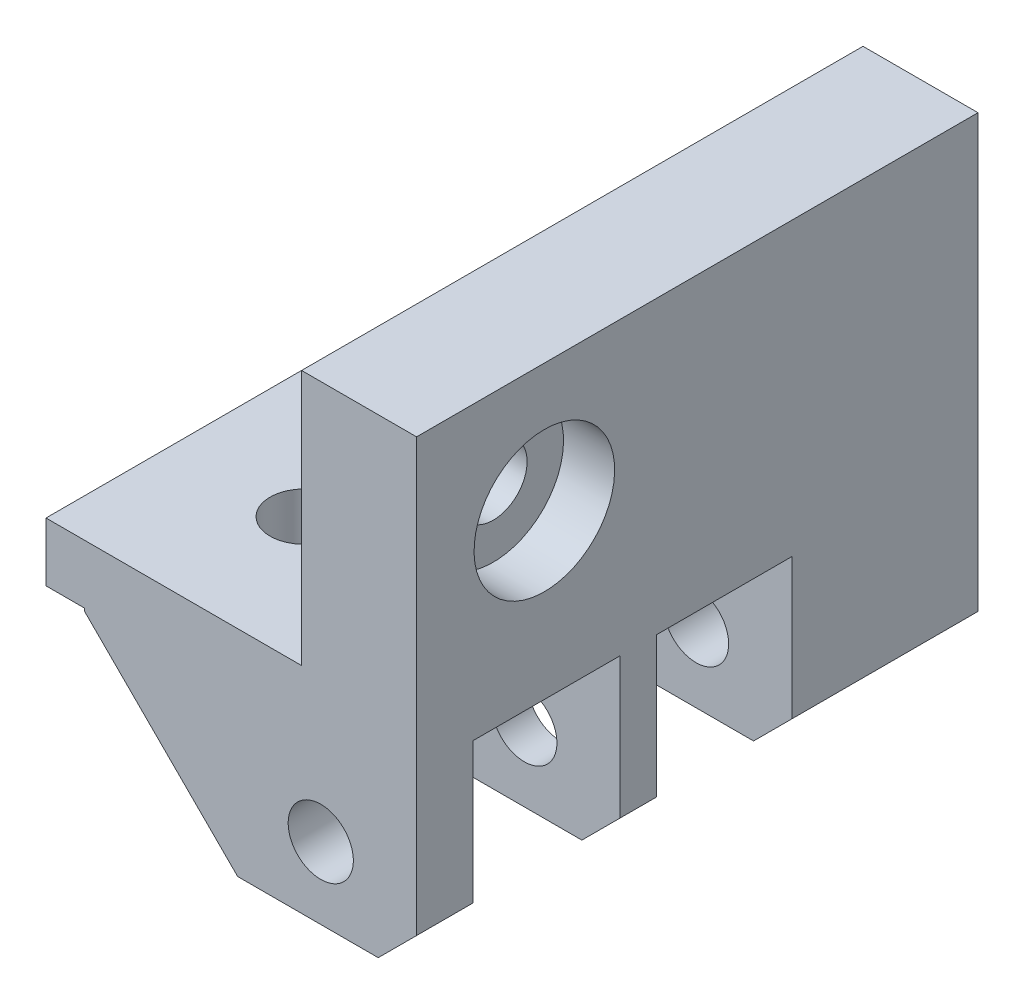
ISO-10303-21;
HEADER;
FILE_DESCRIPTION(('STEP AP214'),'2;1');
FILE_NAME('part.step','',(''),(''),'','','');
FILE_SCHEMA(('AUTOMOTIVE_DESIGN { 1 0 10303 214 1 1 1 1 }'));
ENDSEC;
DATA;
#1=APPLICATION_CONTEXT('core data for automotive mechanical design processes');
#2=APPLICATION_PROTOCOL_DEFINITION('international standard','automotive_design',2000,#1);
#3=PRODUCT_CONTEXT('',#1,'mechanical');
#4=PRODUCT('Part','Part','',(#3));
#5=PRODUCT_RELATED_PRODUCT_CATEGORY('part','',(#4));
#6=PRODUCT_DEFINITION_FORMATION('','',#4);
#7=PRODUCT_DEFINITION_CONTEXT('part definition',#1,'design');
#8=PRODUCT_DEFINITION('design','',#6,#7);
#9=PRODUCT_DEFINITION_SHAPE('','',#8);
#10=(LENGTH_UNIT() NAMED_UNIT(*) SI_UNIT(.MILLI.,.METRE.));
#11=(NAMED_UNIT(*) PLANE_ANGLE_UNIT() SI_UNIT($,.RADIAN.));
#12=(NAMED_UNIT(*) SI_UNIT($,.STERADIAN.) SOLID_ANGLE_UNIT());
#13=UNCERTAINTY_MEASURE_WITH_UNIT(LENGTH_MEASURE(1.E-05),#10,'distance_accuracy_value','');
#14=(GEOMETRIC_REPRESENTATION_CONTEXT(3) GLOBAL_UNCERTAINTY_ASSIGNED_CONTEXT((#13)) GLOBAL_UNIT_ASSIGNED_CONTEXT((#10,
#11,#12)) REPRESENTATION_CONTEXT('',''));
#15=CARTESIAN_POINT('',(0.,0.,0.));
#16=DIRECTION('',(0.,0.,1.));
#17=DIRECTION('',(1.,0.,0.));
#18=AXIS2_PLACEMENT_3D('',#15,#16,#17);
#19=CARTESIAN_POINT('',(-160.,155.,-31.565105608093));
#20=DIRECTION('',(0.,0.,-1.));
#21=DIRECTION('',(0.,-1.,0.));
#22=AXIS2_PLACEMENT_3D('',#19,#20,#21);
#23=PLANE('',#22);
#24=CARTESIAN_POINT('',(-158.500000052155,143.805749978039,-31.565105608093));
#25=DIRECTION('',(0.,0.,1.));
#26=DIRECTION('',(1.,0.,0.));
#27=AXIS2_PLACEMENT_3D('',#24,#25,#26);
#28=CIRCLE('',#27,2.55);
#29=CARTESIAN_POINT('',(-161.050000052155,143.805749978039,-31.565105608093));
#30=VERTEX_POINT('',#29);
#31=EDGE_CURVE('E521',#30,#30,#28,.T.);
#32=ORIENTED_EDGE('',*,*,#31,.F.);
#33=EDGE_LOOP('',(#32));
#34=FACE_BOUND('',#33,.T.);
#35=DIRECTION('',(-1.,0.,0.));
#36=VECTOR('',#35,1.);
#37=CARTESIAN_POINT('',(-160.,150.4,-31.565105608093));
#38=LINE('',#37,#36);
#39=CARTESIAN_POINT('',(-177.000002294779,150.4,-31.565105608093));
#40=VERTEX_POINT('',#39);
#41=CARTESIAN_POINT('',(-180.,150.4,-31.565105608093));
#42=VERTEX_POINT('',#41);
#43=EDGE_CURVE('E421',#40,#42,#38,.T.);
#44=ORIENTED_EDGE('',*,*,#43,.F.);
#45=DIRECTION('',(0.,1.,0.));
#46=VECTOR('',#45,1.);
#47=CARTESIAN_POINT('',(-177.000002294779,152.6,-31.565105608093));
#48=LINE('',#47,#46);
#49=CARTESIAN_POINT('',(-177.000002294779,150.2,-31.565105608093));
#50=VERTEX_POINT('',#49);
#51=EDGE_CURVE('E445',#50,#40,#48,.T.);
#52=ORIENTED_EDGE('',*,*,#51,.F.);
#53=DIRECTION('',(0.707106781186548,-0.707106781186547,0.));
#54=VECTOR('',#53,1.);
#55=CARTESIAN_POINT('',(-170.950001721084,144.149999426305,-31.565105608093));
#56=LINE('',#55,#54);
#57=CARTESIAN_POINT('',(-165.000002294779,138.2,-31.565105608093));
#58=VERTEX_POINT('',#57);
#59=EDGE_CURVE('E466',#50,#58,#56,.T.);
#60=ORIENTED_EDGE('',*,*,#59,.T.);
#61=DIRECTION('',(-1.,0.,0.));
#62=VECTOR('',#61,1.);
#63=CARTESIAN_POINT('',(-164.000002294779,138.2,-31.565105608093));
#64=LINE('',#63,#62);
#65=CARTESIAN_POINT('',(-154.,138.2,-31.565105608093));
#66=VERTEX_POINT('',#65);
#67=EDGE_CURVE('E26',#66,#58,#64,.T.);
#68=ORIENTED_EDGE('',*,*,#67,.F.);
#69=DIRECTION('',(0.707106781186545,0.70710678118655,0.));
#70=VECTOR('',#69,1.);
#71=CARTESIAN_POINT('',(-150.55,141.65,-31.565105608093));
#72=LINE('',#71,#70);
#73=CARTESIAN_POINT('',(-151.,141.2,-31.565105608093));
#74=VERTEX_POINT('',#73);
#75=EDGE_CURVE('E457',#66,#74,#72,.T.);
#76=ORIENTED_EDGE('',*,*,#75,.T.);
#77=DIRECTION('',(0.,1.,0.));
#78=VECTOR('',#77,1.);
#79=CARTESIAN_POINT('',(-151.,175.,-31.565105608093));
#80=LINE('',#79,#78);
#81=CARTESIAN_POINT('',(-151.,175.,-31.565105608093));
#82=VERTEX_POINT('',#81);
#83=EDGE_CURVE('E586',#74,#82,#80,.T.);
#84=ORIENTED_EDGE('',*,*,#83,.T.);
#85=DIRECTION('',(1.,0.,0.));
#86=VECTOR('',#85,1.);
#87=CARTESIAN_POINT('',(-160.,175.,-31.565105608093));
#88=LINE('',#87,#86);
#89=CARTESIAN_POINT('',(-160.,175.,-31.565105608093));
#90=VERTEX_POINT('',#89);
#91=EDGE_CURVE('E507',#90,#82,#88,.T.);
#92=ORIENTED_EDGE('',*,*,#91,.F.);
#93=DIRECTION('',(0.,-1.,0.));
#94=VECTOR('',#93,1.);
#95=CARTESIAN_POINT('',(-160.,155.,-31.565105608093));
#96=LINE('',#95,#94);
#97=CARTESIAN_POINT('',(-160.,155.,-31.565105608093));
#98=VERTEX_POINT('',#97);
#99=EDGE_CURVE('E353',#90,#98,#96,.T.);
#100=ORIENTED_EDGE('',*,*,#99,.T.);
#101=DIRECTION('',(-1.,0.,0.));
#102=VECTOR('',#101,1.);
#103=CARTESIAN_POINT('',(-160.,155.,-31.565105608093));
#104=LINE('',#103,#102);
#105=CARTESIAN_POINT('',(-180.,155.,-31.565105608093));
#106=VERTEX_POINT('',#105);
#107=EDGE_CURVE('E446',#98,#106,#104,.T.);
#108=ORIENTED_EDGE('',*,*,#107,.T.);
#109=DIRECTION('',(0.,-1.,0.));
#110=VECTOR('',#109,1.);
#111=CARTESIAN_POINT('',(-180.,150.2,-31.565105608093));
#112=LINE('',#111,#110);
#113=EDGE_CURVE('E513',#106,#42,#112,.T.);
#114=ORIENTED_EDGE('',*,*,#113,.T.);
#115=EDGE_LOOP('',(#44,#52,#60,#68,#76,#84,#92,#100,#108,#114));
#116=FACE_BOUND('',#115,.T.);
#117=ADVANCED_FACE('F16',(#34,#116),#23,.F.);
#118=CARTESIAN_POINT('',(-160.00000115484,138.2,-48.914300543803));
#119=DIRECTION('',(0.,1.,0.));
#120=DIRECTION('',(1.,0.,0.));
#121=AXIS2_PLACEMENT_3D('',#118,#119,#120);
#122=PLANE('',#121);
#123=DIRECTION('',(0.,0.,1.));
#124=VECTOR('',#123,1.);
#125=CARTESIAN_POINT('',(-154.,138.2,-48.8327904992779));
#126=LINE('',#125,#124);
#127=CARTESIAN_POINT('',(-154.,138.2,-50.3286000817777));
#128=VERTEX_POINT('',#127);
#129=CARTESIAN_POINT('',(-154.,138.2,-47.5000010058284));
#130=VERTEX_POINT('',#129);
#131=EDGE_CURVE('E461',#128,#130,#126,.T.);
#132=ORIENTED_EDGE('',*,*,#131,.T.);
#133=DIRECTION('',(1.,0.,0.));
#134=VECTOR('',#133,1.);
#135=CARTESIAN_POINT('',(-165.00000230968,138.2,-47.5000010058284));
#136=LINE('',#135,#134);
#137=CARTESIAN_POINT('',(-165.00000230968,138.2,-47.5000010058284));
#138=VERTEX_POINT('',#137);
#139=EDGE_CURVE('E11',#138,#130,#136,.T.);
#140=ORIENTED_EDGE('',*,*,#139,.F.);
#141=DIRECTION('',(0.,0.,1.));
#142=VECTOR('',#141,1.);
#143=CARTESIAN_POINT('',(-165.00000230968,138.2,-50.3286000817777));
#144=LINE('',#143,#142);
#145=CARTESIAN_POINT('',(-165.00000230968,138.2,-50.3286000817777));
#146=VERTEX_POINT('',#145);
#147=EDGE_CURVE('E282',#146,#138,#144,.T.);
#148=ORIENTED_EDGE('',*,*,#147,.F.);
#149=DIRECTION('',(1.,0.,0.));
#150=VECTOR('',#149,1.);
#151=CARTESIAN_POINT('',(-155.,138.2,-50.3286000817777));
#152=LINE('',#151,#150);
#153=EDGE_CURVE('E347',#146,#128,#152,.T.);
#154=ORIENTED_EDGE('',*,*,#153,.T.);
#155=EDGE_LOOP('',(#132,#140,#148,#154));
#156=FACE_BOUND('',#155,.T.);
#157=ADVANCED_FACE('F1104',(#156),#122,.F.);
#158=CARTESIAN_POINT('',(-165.00000230968,150.2,-47.5000010058284));
#159=DIRECTION('',(0.,0.,-1.));
#160=DIRECTION('',(0.,-1.,0.));
#161=AXIS2_PLACEMENT_3D('',#158,#159,#160);
#162=PLANE('',#161);
#163=CARTESIAN_POINT('',(-158.500000052155,143.805749978039,-47.5000010058284));
#164=DIRECTION('',(0.,0.,1.));
#165=DIRECTION('',(1.,0.,0.));
#166=AXIS2_PLACEMENT_3D('',#163,#164,#165);
#167=CIRCLE('',#166,2.55);
#168=CARTESIAN_POINT('',(-161.050000052155,143.805749978039,-47.5000010058284));
#169=VERTEX_POINT('',#168);
#170=EDGE_CURVE('E336',#169,#169,#167,.T.);
#171=ORIENTED_EDGE('',*,*,#170,.F.);
#172=EDGE_LOOP('',(#171));
#173=FACE_BOUND('',#172,.T.);
#174=DIRECTION('',(-0.70710678118656,-0.707106781186535,0.));
#175=VECTOR('',#174,1.);
#176=CARTESIAN_POINT('',(-164.25000144355,150.94999971129,-47.5000010058284));
#177=LINE('',#176,#175);
#178=CARTESIAN_POINT('',(-163.00000115484,152.2,-47.5000010058284));
#179=VERTEX_POINT('',#178);
#180=CARTESIAN_POINT('',(-164.00000115484,151.2,-47.5000010058284));
#181=VERTEX_POINT('',#180);
#182=EDGE_CURVE('E361',#179,#181,#177,.T.);
#183=ORIENTED_EDGE('',*,*,#182,.T.);
#184=DIRECTION('',(0.,1.,0.));
#185=VECTOR('',#184,1.);
#186=CARTESIAN_POINT('',(-164.00000115484,150.2,-47.5000010058284));
#187=LINE('',#186,#185);
#188=CARTESIAN_POINT('',(-164.00000115484,150.4,-47.5000010058284));
#189=VERTEX_POINT('',#188);
#190=EDGE_CURVE('E504',#189,#181,#187,.T.);
#191=ORIENTED_EDGE('',*,*,#190,.F.);
#192=DIRECTION('',(1.,0.,0.));
#193=VECTOR('',#192,1.);
#194=CARTESIAN_POINT('',(-162.50000115484,150.4,-47.5000010058284));
#195=LINE('',#194,#193);
#196=CARTESIAN_POINT('',(-177.00000230968,150.4,-47.5000010058284));
#197=VERTEX_POINT('',#196);
#198=EDGE_CURVE('E436',#197,#189,#195,.T.);
#199=ORIENTED_EDGE('',*,*,#198,.F.);
#200=DIRECTION('',(0.,1.,0.));
#201=VECTOR('',#200,1.);
#202=CARTESIAN_POINT('',(-177.00000230968,150.2,-47.5000010058284));
#203=LINE('',#202,#201);
#204=CARTESIAN_POINT('',(-177.00000230968,150.2,-47.5000010058284));
#205=VERTEX_POINT('',#204);
#206=EDGE_CURVE('E444',#205,#197,#203,.T.);
#207=ORIENTED_EDGE('',*,*,#206,.F.);
#208=DIRECTION('',(0.707106781186548,-0.707106781186548,0.));
#209=VECTOR('',#208,1.);
#210=CARTESIAN_POINT('',(-171.00000230968,144.2,-47.5000010058284));
#211=LINE('',#210,#209);
#212=EDGE_CURVE('E462',#205,#138,#211,.T.);
#213=ORIENTED_EDGE('',*,*,#212,.T.);
#214=ORIENTED_EDGE('',*,*,#139,.T.);
#215=DIRECTION('',(0.707106781186545,0.70710678118655,0.));
#216=VECTOR('',#215,1.);
#217=CARTESIAN_POINT('',(-153.00000057742,139.19999942258,-47.5000010058284));
#218=LINE('',#217,#216);
#219=CARTESIAN_POINT('',(-151.,141.2,-47.5000010058284));
#220=VERTEX_POINT('',#219);
#221=EDGE_CURVE('E536',#130,#220,#218,.T.);
#222=ORIENTED_EDGE('',*,*,#221,.T.);
#223=DIRECTION('',(0.,1.,0.));
#224=VECTOR('',#223,1.);
#225=CARTESIAN_POINT('',(-151.,138.2,-47.5000010058284));
#226=LINE('',#225,#224);
#227=CARTESIAN_POINT('',(-151.,152.2,-47.5000010058284));
#228=VERTEX_POINT('',#227);
#229=EDGE_CURVE('E501',#220,#228,#226,.T.);
#230=ORIENTED_EDGE('',*,*,#229,.T.);
#231=DIRECTION('',(1.,0.,0.));
#232=VECTOR('',#231,1.);
#233=CARTESIAN_POINT('',(-164.00000115484,152.2,-47.5000010058284));
#234=LINE('',#233,#232);
#235=EDGE_CURVE('E342',#179,#228,#234,.T.);
#236=ORIENTED_EDGE('',*,*,#235,.F.);
#237=EDGE_LOOP('',(#183,#191,#199,#207,#213,#214,#222,#230,#236));
#238=FACE_BOUND('',#237,.T.);
#239=ADVANCED_FACE('F1099',(#173,#238),#162,.F.);
#240=CARTESIAN_POINT('',(-159.500001147389,138.2,-33.782553221279));
#241=DIRECTION('',(0.,1.,0.));
#242=DIRECTION('',(1.,0.,0.));
#243=AXIS2_PLACEMENT_3D('',#240,#241,#242);
#244=PLANE('',#243);
#245=DIRECTION('',(0.,0.,1.));
#246=VECTOR('',#245,1.);
#247=CARTESIAN_POINT('',(-154.,138.2,-41.2669168380159));
#248=LINE('',#247,#246);
#249=CARTESIAN_POINT('',(-154.,138.2,-36.000000834465));
#250=VERTEX_POINT('',#249);
#251=EDGE_CURVE('E460',#250,#66,#248,.T.);
#252=ORIENTED_EDGE('',*,*,#251,.T.);
#253=ORIENTED_EDGE('',*,*,#67,.T.);
#254=DIRECTION('',(0.,0.,-1.));
#255=VECTOR('',#254,1.);
#256=CARTESIAN_POINT('',(-165.000002294779,138.2,-31.565105608093));
#257=LINE('',#256,#255);
#258=CARTESIAN_POINT('',(-165.000002294779,138.2,-36.000000834465));
#259=VERTEX_POINT('',#258);
#260=EDGE_CURVE('E508',#58,#259,#257,.T.);
#261=ORIENTED_EDGE('',*,*,#260,.T.);
#262=DIRECTION('',(1.,0.,0.));
#263=VECTOR('',#262,1.);
#264=CARTESIAN_POINT('',(-155.,138.2,-36.000000834465));
#265=LINE('',#264,#263);
#266=EDGE_CURVE('E402',#259,#250,#265,.T.);
#267=ORIENTED_EDGE('',*,*,#266,.T.);
#268=EDGE_LOOP('',(#252,#253,#261,#267));
#269=FACE_BOUND('',#268,.T.);
#270=ADVANCED_FACE('F1103',(#269),#244,.F.);
#271=CARTESIAN_POINT('',(-171.00000230968,144.2,-73.4131251541299));
#272=DIRECTION('',(0.707106781186548,0.707106781186548,0.));
#273=DIRECTION('',(0.,0.,-1.));
#274=AXIS2_PLACEMENT_3D('',#271,#272,#273);
#275=PLANE('',#274);
#276=ORIENTED_EDGE('',*,*,#212,.F.);
#277=DIRECTION('',(0.,0.,1.));
#278=VECTOR('',#277,1.);
#279=CARTESIAN_POINT('',(-177.00000230968,150.2,-73.4131251541299));
#280=LINE('',#279,#278);
#281=CARTESIAN_POINT('',(-177.00000230968,150.2,-50.3286000817777));
#282=VERTEX_POINT('',#281);
#283=EDGE_CURVE('E271',#282,#205,#280,.T.);
#284=ORIENTED_EDGE('',*,*,#283,.F.);
#285=DIRECTION('',(-0.707106781186548,0.707106781186548,0.));
#286=VECTOR('',#285,1.);
#287=CARTESIAN_POINT('',(-168.50000173226,141.69999942258,-50.3286000817777));
#288=LINE('',#287,#286);
#289=EDGE_CURVE('E556',#146,#282,#288,.T.);
#290=ORIENTED_EDGE('',*,*,#289,.F.);
#291=ORIENTED_EDGE('',*,*,#147,.T.);
#292=EDGE_LOOP('',(#276,#284,#290,#291));
#293=FACE_BOUND('',#292,.T.);
#294=ADVANCED_FACE('F1113',(#293),#275,.F.);
#295=CARTESIAN_POINT('',(-171.000002294779,144.2,-66.2488255304736));
#296=DIRECTION('',(0.707106781186547,0.707106781186548,0.));
#297=DIRECTION('',(0.,0.,-1.));
#298=AXIS2_PLACEMENT_3D('',#295,#296,#297);
#299=PLANE('',#298);
#300=DIRECTION('',(-0.707106781186548,0.707106781186547,0.));
#301=VECTOR('',#300,1.);
#302=CARTESIAN_POINT('',(-168.500001721084,141.699999426305,-36.000000834465));
#303=LINE('',#302,#301);
#304=CARTESIAN_POINT('',(-177.000002294779,150.2,-36.000000834465));
#305=VERTEX_POINT('',#304);
#306=EDGE_CURVE('E390',#259,#305,#303,.T.);
#307=ORIENTED_EDGE('',*,*,#306,.F.);
#308=ORIENTED_EDGE('',*,*,#260,.F.);
#309=ORIENTED_EDGE('',*,*,#59,.F.);
#310=DIRECTION('',(0.,0.,1.));
#311=VECTOR('',#310,1.);
#312=CARTESIAN_POINT('',(-177.000002294779,150.2,-66.2488255304736));
#313=LINE('',#312,#311);
#314=EDGE_CURVE('E420',#305,#50,#313,.T.);
#315=ORIENTED_EDGE('',*,*,#314,.F.);
#316=EDGE_LOOP('',(#307,#308,#309,#315));
#317=FACE_BOUND('',#316,.T.);
#318=ADVANCED_FACE('F1118',(#317),#299,.F.);
#319=CARTESIAN_POINT('',(-152.5,139.7,-41.2669168380159));
#320=DIRECTION('',(-0.70710678118655,0.707106781186545,0.));
#321=DIRECTION('',(0.,0.,1.));
#322=AXIS2_PLACEMENT_3D('',#319,#320,#321);
#323=PLANE('',#322);
#324=ORIENTED_EDGE('',*,*,#75,.F.);
#325=ORIENTED_EDGE('',*,*,#251,.F.);
#326=DIRECTION('',(-0.707106781186545,-0.70710678118655,0.));
#327=VECTOR('',#326,1.);
#328=CARTESIAN_POINT('',(-150.5,141.7,-36.000000834465));
#329=LINE('',#328,#327);
#330=CARTESIAN_POINT('',(-151.,141.2,-36.000000834465));
#331=VERTEX_POINT('',#330);
#332=EDGE_CURVE('E410',#331,#250,#329,.T.);
#333=ORIENTED_EDGE('',*,*,#332,.F.);
#334=DIRECTION('',(0.,0.,-1.));
#335=VECTOR('',#334,1.);
#336=CARTESIAN_POINT('',(-151.,141.2,-41.2669168380159));
#337=LINE('',#336,#335);
#338=EDGE_CURVE('E583',#74,#331,#337,.T.);
#339=ORIENTED_EDGE('',*,*,#338,.F.);
#340=EDGE_LOOP('',(#324,#325,#333,#339));
#341=FACE_BOUND('',#340,.T.);
#342=ADVANCED_FACE('F1122',(#341),#323,.F.);
#343=CARTESIAN_POINT('',(-152.5,139.7,-48.8327904992779));
#344=DIRECTION('',(-0.70710678118655,0.707106781186545,0.));
#345=DIRECTION('',(0.,0.,1.));
#346=AXIS2_PLACEMENT_3D('',#343,#344,#345);
#347=PLANE('',#346);
#348=ORIENTED_EDGE('',*,*,#221,.F.);
#349=ORIENTED_EDGE('',*,*,#131,.F.);
#350=DIRECTION('',(-0.707106781186545,-0.70710678118655,0.));
#351=VECTOR('',#350,1.);
#352=CARTESIAN_POINT('',(-150.5,141.7,-50.3286000817777));
#353=LINE('',#352,#351);
#354=CARTESIAN_POINT('',(-151.,141.2,-50.3286000817777));
#355=VERTEX_POINT('',#354);
#356=EDGE_CURVE('E343',#355,#128,#353,.T.);
#357=ORIENTED_EDGE('',*,*,#356,.F.);
#358=DIRECTION('',(0.,0.,-1.));
#359=VECTOR('',#358,1.);
#360=CARTESIAN_POINT('',(-151.,141.2,-48.8327904992779));
#361=LINE('',#360,#359);
#362=EDGE_CURVE('E497',#220,#355,#361,.T.);
#363=ORIENTED_EDGE('',*,*,#362,.F.);
#364=EDGE_LOOP('',(#348,#349,#357,#363));
#365=FACE_BOUND('',#364,.T.);
#366=ADVANCED_FACE('F1203',(#365),#347,.F.);
#367=CARTESIAN_POINT('',(-170.000002384186,150.2,-41.7500007711351));
#368=DIRECTION('',(0.,-1.,0.));
#369=DIRECTION('',(-1.,0.,0.));
#370=AXIS2_PLACEMENT_3D('',#367,#368,#369);
#371=CYLINDRICAL_SURFACE('',#370,2.65);
#372=CARTESIAN_POINT('',(-170.000002384186,150.4,-41.7500007711351));
#373=DIRECTION('',(0.,1.,0.));
#374=DIRECTION('',(-1.,0.,0.));
#375=AXIS2_PLACEMENT_3D('',#372,#373,#374);
#376=CIRCLE('',#375,2.65);
#377=CARTESIAN_POINT('',(-167.350002384186,150.4,-41.7500007711351));
#378=VERTEX_POINT('',#377);
#379=EDGE_CURVE('E416',#378,#378,#376,.T.);
#380=ORIENTED_EDGE('',*,*,#379,.F.);
#381=DIRECTION('',(0.,1.,0.));
#382=VECTOR('',#381,1.);
#383=CARTESIAN_POINT('',(-167.350002384186,150.2,-41.7500007711351));
#384=LINE('',#383,#382);
#385=CARTESIAN_POINT('',(-167.350002384186,155.,-41.7500007711351));
#386=VERTEX_POINT('',#385);
#387=EDGE_CURVE('E533',#378,#386,#384,.T.);
#388=ORIENTED_EDGE('',*,*,#387,.T.);
#389=CARTESIAN_POINT('',(-170.000002384186,155.,-41.7500007711351));
#390=DIRECTION('',(0.,1.,0.));
#391=DIRECTION('',(-1.,0.,0.));
#392=AXIS2_PLACEMENT_3D('',#389,#390,#391);
#393=CIRCLE('',#392,2.65);
#394=EDGE_CURVE('E449',#386,#386,#393,.T.);
#395=ORIENTED_EDGE('',*,*,#394,.T.);
#396=ORIENTED_EDGE('',*,*,#387,.F.);
#397=EDGE_LOOP('',(#380,#388,#395,#396));
#398=FACE_BOUND('',#397,.T.);
#399=ADVANCED_FACE('F1063',(#398),#371,.F.);
#400=CARTESIAN_POINT('',(-164.00000115484,150.2,-50.3286000817777));
#401=DIRECTION('',(1.,0.,0.));
#402=DIRECTION('',(0.,1.,0.));
#403=AXIS2_PLACEMENT_3D('',#400,#401,#402);
#404=PLANE('',#403);
#405=DIRECTION('',(0.,0.,-1.));
#406=VECTOR('',#405,1.);
#407=CARTESIAN_POINT('',(-164.00000115484,151.2,-52.9807003630818));
#408=LINE('',#407,#406);
#409=CARTESIAN_POINT('',(-164.00000115484,151.2,-50.3286000817777));
#410=VERTEX_POINT('',#409);
#411=CARTESIAN_POINT('',(-164.00000115484,151.2,-60.9370012069941));
#412=VERTEX_POINT('',#411);
#413=EDGE_CURVE('E375',#410,#412,#408,.T.);
#414=ORIENTED_EDGE('',*,*,#413,.F.);
#415=DIRECTION('',(0.,1.,0.));
#416=VECTOR('',#415,1.);
#417=CARTESIAN_POINT('',(-164.00000115484,150.2,-50.3286000817777));
#418=LINE('',#417,#416);
#419=CARTESIAN_POINT('',(-164.00000115484,150.4,-50.3286000817777));
#420=VERTEX_POINT('',#419);
#421=EDGE_CURVE('E360',#420,#410,#418,.T.);
#422=ORIENTED_EDGE('',*,*,#421,.F.);
#423=DIRECTION('',(0.,0.,1.));
#424=VECTOR('',#423,1.);
#425=CARTESIAN_POINT('',(-164.00000115484,150.4,-73.4131251541299));
#426=LINE('',#425,#424);
#427=CARTESIAN_POINT('',(-164.00000115484,150.4,-60.9370012069941));
#428=VERTEX_POINT('',#427);
#429=EDGE_CURVE('E426',#428,#420,#426,.T.);
#430=ORIENTED_EDGE('',*,*,#429,.F.);
#431=DIRECTION('',(0.,1.,0.));
#432=VECTOR('',#431,1.);
#433=CARTESIAN_POINT('',(-164.00000115484,150.2,-60.9370012069941));
#434=LINE('',#433,#432);
#435=EDGE_CURVE('E427',#428,#412,#434,.T.);
#436=ORIENTED_EDGE('',*,*,#435,.T.);
#437=EDGE_LOOP('',(#414,#422,#430,#436));
#438=FACE_BOUND('',#437,.T.);
#439=ADVANCED_FACE('F712',(#438),#404,.T.);
#440=CARTESIAN_POINT('',(-151.,165.,-41.565105608093));
#441=DIRECTION('',(1.,0.,0.));
#442=DIRECTION('',(0.,-1.,0.));
#443=AXIS2_PLACEMENT_3D('',#440,#441,#442);
#444=CYLINDRICAL_SURFACE('',#443,2.65);
#445=CARTESIAN_POINT('',(-155.,165.,-41.565105608093));
#446=DIRECTION('',(-1.,0.,0.));
#447=DIRECTION('',(0.,-1.,0.));
#448=AXIS2_PLACEMENT_3D('',#445,#446,#447);
#449=CIRCLE('',#448,2.65);
#450=CARTESIAN_POINT('',(-155.,167.65,-41.565105608093));
#451=VERTEX_POINT('',#450);
#452=EDGE_CURVE('E327',#451,#451,#449,.T.);
#453=ORIENTED_EDGE('',*,*,#452,.F.);
#454=DIRECTION('',(-1.,0.,0.));
#455=VECTOR('',#454,1.);
#456=CARTESIAN_POINT('',(-151.,167.65,-41.565105608093));
#457=LINE('',#456,#455);
#458=CARTESIAN_POINT('',(-160.,167.65,-41.565105608093));
#459=VERTEX_POINT('',#458);
#460=EDGE_CURVE('E537',#451,#459,#457,.T.);
#461=ORIENTED_EDGE('',*,*,#460,.T.);
#462=CARTESIAN_POINT('',(-160.,165.,-41.565105608093));
#463=DIRECTION('',(-1.,0.,0.));
#464=DIRECTION('',(0.,-1.,0.));
#465=AXIS2_PLACEMENT_3D('',#462,#463,#464);
#466=CIRCLE('',#465,2.65);
#467=EDGE_CURVE('E546',#459,#459,#466,.T.);
#468=ORIENTED_EDGE('',*,*,#467,.T.);
#469=ORIENTED_EDGE('',*,*,#460,.F.);
#470=EDGE_LOOP('',(#453,#461,#468,#469));
#471=FACE_BOUND('',#470,.T.);
#472=ADVANCED_FACE('F1036',(#471),#444,.F.);
#473=CARTESIAN_POINT('',(-160.,175.,-31.565105608093));
#474=DIRECTION('',(0.,-1.,0.));
#475=DIRECTION('',(0.,0.,-1.));
#476=AXIS2_PLACEMENT_3D('',#473,#474,#475);
#477=PLANE('',#476);
#478=DIRECTION('',(1.,0.,0.));
#479=VECTOR('',#478,1.);
#480=CARTESIAN_POINT('',(-157.5,175.,-75.5004553014124));
#481=LINE('',#480,#479);
#482=CARTESIAN_POINT('',(-160.,175.,-75.5004553014124));
#483=VERTEX_POINT('',#482);
#484=CARTESIAN_POINT('',(-151.,175.,-75.5004553014124));
#485=VERTEX_POINT('',#484);
#486=EDGE_CURVE('E495',#483,#485,#481,.T.);
#487=ORIENTED_EDGE('',*,*,#486,.F.);
#488=DIRECTION('',(0.,0.,-1.));
#489=VECTOR('',#488,1.);
#490=CARTESIAN_POINT('',(-160.,175.,-95.9996502264822));
#491=LINE('',#490,#489);
#492=EDGE_CURVE('E20',#90,#483,#491,.T.);
#493=ORIENTED_EDGE('',*,*,#492,.F.);
#494=ORIENTED_EDGE('',*,*,#91,.T.);
#495=DIRECTION('',(0.,0.,-1.));
#496=VECTOR('',#495,1.);
#497=CARTESIAN_POINT('',(-151.,175.,-65.9374553014124));
#498=LINE('',#497,#496);
#499=EDGE_CURVE('E494',#82,#485,#498,.T.);
#500=ORIENTED_EDGE('',*,*,#499,.T.);
#501=EDGE_LOOP('',(#487,#493,#494,#500));
#502=FACE_BOUND('',#501,.T.);
#503=ADVANCED_FACE('F724',(#502),#477,.F.);
#504=CARTESIAN_POINT('',(-164.00000115484,150.2,-36.000000834465));
#505=DIRECTION('',(1.,0.,0.));
#506=DIRECTION('',(0.,1.,0.));
#507=AXIS2_PLACEMENT_3D('',#504,#505,#506);
#508=PLANE('',#507);
#509=DIRECTION('',(0.,0.,-1.));
#510=VECTOR('',#509,1.);
#511=CARTESIAN_POINT('',(-164.00000115484,151.2,-38.8750008773059));
#512=LINE('',#511,#510);
#513=CARTESIAN_POINT('',(-164.00000115484,151.2,-36.000000834465));
#514=VERTEX_POINT('',#513);
#515=EDGE_CURVE('E381',#514,#181,#512,.T.);
#516=ORIENTED_EDGE('',*,*,#515,.F.);
#517=DIRECTION('',(0.,1.,0.));
#518=VECTOR('',#517,1.);
#519=CARTESIAN_POINT('',(-164.00000115484,150.2,-36.000000834465));
#520=LINE('',#519,#518);
#521=CARTESIAN_POINT('',(-164.00000115484,150.4,-36.000000834465));
#522=VERTEX_POINT('',#521);
#523=EDGE_CURVE('E400',#522,#514,#520,.T.);
#524=ORIENTED_EDGE('',*,*,#523,.F.);
#525=DIRECTION('',(0.,0.,1.));
#526=VECTOR('',#525,1.);
#527=CARTESIAN_POINT('',(-164.00000115484,150.4,-66.2488255304736));
#528=LINE('',#527,#526);
#529=EDGE_CURVE('E437',#189,#522,#528,.T.);
#530=ORIENTED_EDGE('',*,*,#529,.F.);
#531=ORIENTED_EDGE('',*,*,#190,.T.);
#532=EDGE_LOOP('',(#516,#524,#530,#531));
#533=FACE_BOUND('',#532,.T.);
#534=ADVANCED_FACE('F1035',(#533),#508,.T.);
#535=CARTESIAN_POINT('',(-177.00000230968,150.2,-50.3286000817777));
#536=DIRECTION('',(-1.,0.,0.));
#537=DIRECTION('',(0.,0.,1.));
#538=AXIS2_PLACEMENT_3D('',#535,#536,#537);
#539=PLANE('',#538);
#540=ORIENTED_EDGE('',*,*,#283,.T.);
#541=ORIENTED_EDGE('',*,*,#206,.T.);
#542=DIRECTION('',(0.,0.,1.));
#543=VECTOR('',#542,1.);
#544=CARTESIAN_POINT('',(-177.00000230968,150.4,-73.4131251541299));
#545=LINE('',#544,#543);
#546=CARTESIAN_POINT('',(-177.00000230968,150.4,-50.3286000817777));
#547=VERTEX_POINT('',#546);
#548=EDGE_CURVE('E432',#547,#197,#545,.T.);
#549=ORIENTED_EDGE('',*,*,#548,.F.);
#550=DIRECTION('',(0.,1.,0.));
#551=VECTOR('',#550,1.);
#552=CARTESIAN_POINT('',(-177.00000230968,150.2,-50.3286000817777));
#553=LINE('',#552,#551);
#554=EDGE_CURVE('E551',#282,#547,#553,.T.);
#555=ORIENTED_EDGE('',*,*,#554,.F.);
#556=EDGE_LOOP('',(#540,#541,#549,#555));
#557=FACE_BOUND('',#556,.T.);
#558=ADVANCED_FACE('F1054',(#557),#539,.T.);
#559=CARTESIAN_POINT('',(-177.000002294779,150.2,-36.000000834465));
#560=DIRECTION('',(-1.,0.,0.));
#561=DIRECTION('',(0.,0.,1.));
#562=AXIS2_PLACEMENT_3D('',#559,#560,#561);
#563=PLANE('',#562);
#564=ORIENTED_EDGE('',*,*,#314,.T.);
#565=ORIENTED_EDGE('',*,*,#51,.T.);
#566=DIRECTION('',(0.,0.,1.));
#567=VECTOR('',#566,1.);
#568=CARTESIAN_POINT('',(-177.000002294779,150.4,-66.2488255304736));
#569=LINE('',#568,#567);
#570=CARTESIAN_POINT('',(-177.000002294779,150.4,-36.000000834465));
#571=VERTEX_POINT('',#570);
#572=EDGE_CURVE('E441',#571,#40,#569,.T.);
#573=ORIENTED_EDGE('',*,*,#572,.F.);
#574=DIRECTION('',(0.,1.,0.));
#575=VECTOR('',#574,1.);
#576=CARTESIAN_POINT('',(-177.000002294779,150.2,-36.000000834465));
#577=LINE('',#576,#575);
#578=EDGE_CURVE('E386',#305,#571,#577,.T.);
#579=ORIENTED_EDGE('',*,*,#578,.F.);
#580=EDGE_LOOP('',(#564,#565,#573,#579));
#581=FACE_BOUND('',#580,.T.);
#582=ADVANCED_FACE('F1131',(#581),#563,.T.);
#583=CARTESIAN_POINT('',(-160.,150.4,-96.4976502264822));
#584=DIRECTION('',(0.,1.,0.));
#585=DIRECTION('',(1.,0.,0.));
#586=AXIS2_PLACEMENT_3D('',#583,#584,#585);
#587=PLANE('',#586);
#588=ORIENTED_EDGE('',*,*,#379,.T.);
#589=EDGE_LOOP('',(#588));
#590=FACE_BOUND('',#589,.T.);
#591=DIRECTION('',(1.,0.,0.));
#592=VECTOR('',#591,1.);
#593=CARTESIAN_POINT('',(-170.128286739568,150.4,-75.5004553014124));
#594=LINE('',#593,#592);
#595=CARTESIAN_POINT('',(-180.,150.4,-75.5004553014124));
#596=VERTEX_POINT('',#595);
#597=CARTESIAN_POINT('',(-165.00000230968,150.4,-75.5004553014124));
#598=VERTEX_POINT('',#597);
#599=EDGE_CURVE('E607',#596,#598,#594,.T.);
#600=ORIENTED_EDGE('',*,*,#599,.T.);
#601=DIRECTION('',(0.,0.,1.));
#602=VECTOR('',#601,1.);
#603=CARTESIAN_POINT('',(-165.00000230968,150.4,-76.0004553014124));
#604=LINE('',#603,#602);
#605=CARTESIAN_POINT('',(-165.00000230968,150.4,-60.9370012069941));
#606=VERTEX_POINT('',#605);
#607=EDGE_CURVE('E338',#598,#606,#604,.T.);
#608=ORIENTED_EDGE('',*,*,#607,.T.);
#609=DIRECTION('',(1.,0.,0.));
#610=VECTOR('',#609,1.);
#611=CARTESIAN_POINT('',(-162.50000115484,150.4,-60.9370012069941));
#612=LINE('',#611,#610);
#613=EDGE_CURVE('E422',#606,#428,#612,.T.);
#614=ORIENTED_EDGE('',*,*,#613,.T.);
#615=ORIENTED_EDGE('',*,*,#429,.T.);
#616=DIRECTION('',(-1.,0.,0.));
#617=VECTOR('',#616,1.);
#618=CARTESIAN_POINT('',(-155.,150.4,-50.3286000817777));
#619=LINE('',#618,#617);
#620=EDGE_CURVE('E555',#420,#547,#619,.T.);
#621=ORIENTED_EDGE('',*,*,#620,.T.);
#622=ORIENTED_EDGE('',*,*,#548,.T.);
#623=ORIENTED_EDGE('',*,*,#198,.T.);
#624=ORIENTED_EDGE('',*,*,#529,.T.);
#625=DIRECTION('',(-1.,0.,0.));
#626=VECTOR('',#625,1.);
#627=CARTESIAN_POINT('',(-155.,150.4,-36.000000834465));
#628=LINE('',#627,#626);
#629=EDGE_CURVE('E389',#522,#571,#628,.T.);
#630=ORIENTED_EDGE('',*,*,#629,.T.);
#631=ORIENTED_EDGE('',*,*,#572,.T.);
#632=ORIENTED_EDGE('',*,*,#43,.T.);
#633=DIRECTION('',(0.,0.,-1.));
#634=VECTOR('',#633,1.);
#635=CARTESIAN_POINT('',(-180.,150.4,-80.2645140718849));
#636=LINE('',#635,#634);
#637=EDGE_CURVE('E518',#42,#596,#636,.T.);
#638=ORIENTED_EDGE('',*,*,#637,.T.);
#639=EDGE_LOOP('',(#600,#608,#614,#615,#621,#622,#623,#624,#630,#631,#632,#638));
#640=FACE_BOUND('',#639,.T.);
#641=ADVANCED_FACE('F667',(#590,#640),#587,.F.);
#642=CARTESIAN_POINT('',(-165.00000230968,150.2,-60.9370012069941));
#643=DIRECTION('',(0.,0.,-1.));
#644=DIRECTION('',(0.,-1.,0.));
#645=AXIS2_PLACEMENT_3D('',#642,#643,#644);
#646=PLANE('',#645);
#647=CARTESIAN_POINT('',(-158.500000052155,143.805749978039,-60.9370012069941));
#648=DIRECTION('',(0.,0.,1.));
#649=DIRECTION('',(1.,0.,0.));
#650=AXIS2_PLACEMENT_3D('',#647,#648,#649);
#651=CIRCLE('',#650,2.55);
#652=CARTESIAN_POINT('',(-161.050000052155,143.805749978039,-60.9370012069941));
#653=VERTEX_POINT('',#652);
#654=EDGE_CURVE('E543',#653,#653,#651,.T.);
#655=ORIENTED_EDGE('',*,*,#654,.F.);
#656=EDGE_LOOP('',(#655));
#657=FACE_BOUND('',#656,.T.);
#658=DIRECTION('',(-0.70710678118656,-0.707106781186535,0.));
#659=VECTOR('',#658,1.);
#660=CARTESIAN_POINT('',(-164.25000144355,150.94999971129,-60.9370012069941));
#661=LINE('',#660,#659);
#662=CARTESIAN_POINT('',(-163.00000115484,152.2,-60.9370012069941));
#663=VERTEX_POINT('',#662);
#664=EDGE_CURVE('E428',#663,#412,#661,.T.);
#665=ORIENTED_EDGE('',*,*,#664,.T.);
#666=ORIENTED_EDGE('',*,*,#435,.F.);
#667=ORIENTED_EDGE('',*,*,#613,.F.);
#668=DIRECTION('',(0.,1.,0.));
#669=VECTOR('',#668,1.);
#670=CARTESIAN_POINT('',(-165.00000230968,150.3,-60.9370012069941));
#671=LINE('',#670,#669);
#672=CARTESIAN_POINT('',(-165.00000230968,138.2,-60.9370012069941));
#673=VERTEX_POINT('',#672);
#674=EDGE_CURVE('E369',#673,#606,#671,.T.);
#675=ORIENTED_EDGE('',*,*,#674,.F.);
#676=DIRECTION('',(1.,0.,0.));
#677=VECTOR('',#676,1.);
#678=CARTESIAN_POINT('',(-155.,138.2,-60.9370012069941));
#679=LINE('',#678,#677);
#680=CARTESIAN_POINT('',(-154.,138.2,-60.9370012069941));
#681=VERTEX_POINT('',#680);
#682=EDGE_CURVE('E370',#673,#681,#679,.T.);
#683=ORIENTED_EDGE('',*,*,#682,.T.);
#684=DIRECTION('',(0.707106781186548,0.707106781186548,0.));
#685=VECTOR('',#684,1.);
#686=CARTESIAN_POINT('',(-153.00000057742,139.19999942258,-60.9370012069941));
#687=LINE('',#686,#685);
#688=CARTESIAN_POINT('',(-151.,141.2,-60.9370012069941));
#689=VERTEX_POINT('',#688);
#690=EDGE_CURVE('E486',#681,#689,#687,.T.);
#691=ORIENTED_EDGE('',*,*,#690,.T.);
#692=DIRECTION('',(0.,1.,0.));
#693=VECTOR('',#692,1.);
#694=CARTESIAN_POINT('',(-151.,138.2,-60.9370012069941));
#695=LINE('',#694,#693);
#696=CARTESIAN_POINT('',(-151.,152.2,-60.9370012069941));
#697=VERTEX_POINT('',#696);
#698=EDGE_CURVE('E500',#689,#697,#695,.T.);
#699=ORIENTED_EDGE('',*,*,#698,.T.);
#700=DIRECTION('',(1.,0.,0.));
#701=VECTOR('',#700,1.);
#702=CARTESIAN_POINT('',(-164.00000115484,152.2,-60.9370012069941));
#703=LINE('',#702,#701);
#704=EDGE_CURVE('E359',#663,#697,#703,.T.);
#705=ORIENTED_EDGE('',*,*,#704,.F.);
#706=EDGE_LOOP('',(#665,#666,#667,#675,#683,#691,#699,#705));
#707=FACE_BOUND('',#706,.T.);
#708=ADVANCED_FACE('F692',(#657,#707),#646,.F.);
#709=CARTESIAN_POINT('',(-158.500000052155,143.805749978039,-31.565105608093));
#710=DIRECTION('',(0.,0.,1.));
#711=DIRECTION('',(1.,0.,0.));
#712=AXIS2_PLACEMENT_3D('',#709,#710,#711);
#713=CYLINDRICAL_SURFACE('',#712,2.55);
#714=ORIENTED_EDGE('',*,*,#654,.T.);
#715=DIRECTION('',(0.,0.,-1.));
#716=VECTOR('',#715,1.);
#717=CARTESIAN_POINT('',(-161.050000052155,143.805749978039,-31.565105608093));
#718=LINE('',#717,#716);
#719=CARTESIAN_POINT('',(-161.050000052155,143.805749978039,-75.5004553014124));
#720=VERTEX_POINT('',#719);
#721=EDGE_CURVE('E540',#653,#720,#718,.T.);
#722=ORIENTED_EDGE('',*,*,#721,.T.);
#723=CARTESIAN_POINT('',(-158.500000052155,143.805749978039,-75.5004553014124));
#724=DIRECTION('',(0.,0.,1.));
#725=DIRECTION('',(1.,0.,0.));
#726=AXIS2_PLACEMENT_3D('',#723,#724,#725);
#727=CIRCLE('',#726,2.55);
#728=EDGE_CURVE('E491',#720,#720,#727,.T.);
#729=ORIENTED_EDGE('',*,*,#728,.F.);
#730=ORIENTED_EDGE('',*,*,#721,.F.);
#731=EDGE_LOOP('',(#714,#722,#729,#730));
#732=FACE_BOUND('',#731,.T.);
#733=ADVANCED_FACE('F1041',(#732),#713,.F.);
#734=CARTESIAN_POINT('',(-158.500000052155,143.805749978039,-31.565105608093));
#735=DIRECTION('',(0.,0.,1.));
#736=DIRECTION('',(1.,0.,0.));
#737=AXIS2_PLACEMENT_3D('',#734,#735,#736);
#738=CYLINDRICAL_SURFACE('',#737,2.55);
#739=ORIENTED_EDGE('',*,*,#31,.T.);
#740=DIRECTION('',(0.,0.,-1.));
#741=VECTOR('',#740,1.);
#742=CARTESIAN_POINT('',(-161.050000052155,143.805749978039,-31.565105608093));
#743=LINE('',#742,#741);
#744=CARTESIAN_POINT('',(-161.050000052155,143.805749978039,-36.000000834465));
#745=VERTEX_POINT('',#744);
#746=EDGE_CURVE('E525',#30,#745,#743,.T.);
#747=ORIENTED_EDGE('',*,*,#746,.T.);
#748=CARTESIAN_POINT('',(-158.500000052155,143.805749978039,-36.000000834465));
#749=DIRECTION('',(0.,0.,-1.));
#750=DIRECTION('',(1.,0.,0.));
#751=AXIS2_PLACEMENT_3D('',#748,#749,#750);
#752=CIRCLE('',#751,2.55);
#753=EDGE_CURVE('E469',#745,#745,#752,.T.);
#754=ORIENTED_EDGE('',*,*,#753,.T.);
#755=ORIENTED_EDGE('',*,*,#746,.F.);
#756=EDGE_LOOP('',(#739,#747,#754,#755));
#757=FACE_BOUND('',#756,.T.);
#758=ADVANCED_FACE('F1045',(#757),#738,.F.);
#759=CARTESIAN_POINT('',(-158.500000052155,143.805749978039,-31.565105608093));
#760=DIRECTION('',(0.,0.,1.));
#761=DIRECTION('',(1.,0.,0.));
#762=AXIS2_PLACEMENT_3D('',#759,#760,#761);
#763=CYLINDRICAL_SURFACE('',#762,2.55);
#764=ORIENTED_EDGE('',*,*,#170,.T.);
#765=DIRECTION('',(0.,0.,-1.));
#766=VECTOR('',#765,1.);
#767=CARTESIAN_POINT('',(-161.050000052155,143.805749978039,-31.565105608093));
#768=LINE('',#767,#766);
#769=CARTESIAN_POINT('',(-161.050000052155,143.805749978039,-50.3286000817777));
#770=VERTEX_POINT('',#769);
#771=EDGE_CURVE('E526',#169,#770,#768,.T.);
#772=ORIENTED_EDGE('',*,*,#771,.T.);
#773=CARTESIAN_POINT('',(-158.500000052155,143.805749978039,-50.3286000817777));
#774=DIRECTION('',(0.,0.,-1.));
#775=DIRECTION('',(1.,0.,0.));
#776=AXIS2_PLACEMENT_3D('',#773,#774,#775);
#777=CIRCLE('',#776,2.55);
#778=EDGE_CURVE('E355',#770,#770,#777,.T.);
#779=ORIENTED_EDGE('',*,*,#778,.T.);
#780=ORIENTED_EDGE('',*,*,#771,.F.);
#781=EDGE_LOOP('',(#764,#772,#779,#780));
#782=FACE_BOUND('',#781,.T.);
#783=ADVANCED_FACE('F1141',(#782),#763,.F.);
#784=CARTESIAN_POINT('',(-155.,165.,-41.565105608093));
#785=DIRECTION('',(-1.,0.,0.));
#786=DIRECTION('',(0.,0.,1.));
#787=AXIS2_PLACEMENT_3D('',#784,#785,#786);
#788=PLANE('',#787);
#789=ORIENTED_EDGE('',*,*,#452,.T.);
#790=EDGE_LOOP('',(#789));
#791=FACE_BOUND('',#790,.T.);
#792=CARTESIAN_POINT('',(-155.,165.,-41.565105608093));
#793=DIRECTION('',(1.,0.,0.));
#794=DIRECTION('',(0.,-1.,0.));
#795=AXIS2_PLACEMENT_3D('',#792,#793,#794);
#796=CIRCLE('',#795,5.5);
#797=CARTESIAN_POINT('',(-155.,170.5,-41.565105608093));
#798=VERTEX_POINT('',#797);
#799=EDGE_CURVE('E322',#798,#798,#796,.T.);
#800=ORIENTED_EDGE('',*,*,#799,.T.);
#801=EDGE_LOOP('',(#800));
#802=FACE_BOUND('',#801,.T.);
#803=ADVANCED_FACE('F323',(#791,#802),#788,.F.);
#804=CARTESIAN_POINT('',(-151.,165.,-41.565105608093));
#805=DIRECTION('',(1.,0.,0.));
#806=DIRECTION('',(0.,-1.,0.));
#807=AXIS2_PLACEMENT_3D('',#804,#805,#806);
#808=CYLINDRICAL_SURFACE('',#807,5.5);
#809=CARTESIAN_POINT('',(-151.,165.,-41.565105608093));
#810=DIRECTION('',(1.,0.,0.));
#811=DIRECTION('',(0.,-1.,0.));
#812=AXIS2_PLACEMENT_3D('',#809,#810,#811);
#813=CIRCLE('',#812,5.5);
#814=CARTESIAN_POINT('',(-151.,170.5,-41.565105608093));
#815=VERTEX_POINT('',#814);
#816=EDGE_CURVE('E482',#815,#815,#813,.T.);
#817=ORIENTED_EDGE('',*,*,#816,.T.);
#818=DIRECTION('',(-1.,0.,0.));
#819=VECTOR('',#818,1.);
#820=CARTESIAN_POINT('',(-151.,170.5,-41.565105608093));
#821=LINE('',#820,#819);
#822=EDGE_CURVE('E328',#815,#798,#821,.T.);
#823=ORIENTED_EDGE('',*,*,#822,.T.);
#824=ORIENTED_EDGE('',*,*,#799,.F.);
#825=ORIENTED_EDGE('',*,*,#822,.F.);
#826=EDGE_LOOP('',(#817,#823,#824,#825));
#827=FACE_BOUND('',#826,.T.);
#828=ADVANCED_FACE('F1140',(#827),#808,.F.);
#829=CARTESIAN_POINT('',(-165.00000230968,150.4,-76.0004553014124));
#830=DIRECTION('',(-1.,0.,0.));
#831=DIRECTION('',(0.,0.,1.));
#832=AXIS2_PLACEMENT_3D('',#829,#830,#831);
#833=PLANE('',#832);
#834=DIRECTION('',(0.,1.,0.));
#835=VECTOR('',#834,1.);
#836=CARTESIAN_POINT('',(-165.00000230968,150.3,-75.5004553014124));
#837=LINE('',#836,#835);
#838=CARTESIAN_POINT('',(-165.00000230968,138.2,-75.5004553014124));
#839=VERTEX_POINT('',#838);
#840=EDGE_CURVE('E477',#839,#598,#837,.T.);
#841=ORIENTED_EDGE('',*,*,#840,.F.);
#842=DIRECTION('',(0.,0.,-1.));
#843=VECTOR('',#842,1.);
#844=CARTESIAN_POINT('',(-165.00000230968,138.2,-65.6394553014124));
#845=LINE('',#844,#843);
#846=EDGE_CURVE('E242',#673,#839,#845,.T.);
#847=ORIENTED_EDGE('',*,*,#846,.F.);
#848=ORIENTED_EDGE('',*,*,#674,.T.);
#849=ORIENTED_EDGE('',*,*,#607,.F.);
#850=EDGE_LOOP('',(#841,#847,#848,#849));
#851=FACE_BOUND('',#850,.T.);
#852=ADVANCED_FACE('F715',(#851),#833,.T.);
#853=CARTESIAN_POINT('',(-160.00000115484,138.2,-63.3197282542032));
#854=DIRECTION('',(0.,1.,0.));
#855=DIRECTION('',(1.,0.,0.));
#856=AXIS2_PLACEMENT_3D('',#853,#854,#855);
#857=PLANE('',#856);
#858=DIRECTION('',(-1.,0.,0.));
#859=VECTOR('',#858,1.);
#860=CARTESIAN_POINT('',(-157.50000057742,138.2,-75.5004553014124));
#861=LINE('',#860,#859);
#862=CARTESIAN_POINT('',(-154.,138.2,-75.5004553014124));
#863=VERTEX_POINT('',#862);
#864=EDGE_CURVE('E473',#863,#839,#861,.T.);
#865=ORIENTED_EDGE('',*,*,#864,.F.);
#866=DIRECTION('',(0.,0.,1.));
#867=VECTOR('',#866,1.);
#868=CARTESIAN_POINT('',(-154.,138.2,-56.035504354478));
#869=LINE('',#868,#867);
#870=EDGE_CURVE('E231',#863,#681,#869,.T.);
#871=ORIENTED_EDGE('',*,*,#870,.T.);
#872=ORIENTED_EDGE('',*,*,#682,.F.);
#873=ORIENTED_EDGE('',*,*,#846,.T.);
#874=EDGE_LOOP('',(#865,#871,#872,#873));
#875=FACE_BOUND('',#874,.T.);
#876=ADVANCED_FACE('F716',(#875),#857,.F.);
#877=CARTESIAN_POINT('',(-152.5,139.7,-56.035504354478));
#878=DIRECTION('',(-0.707106781186548,0.707106781186548,0.));
#879=DIRECTION('',(0.,0.,1.));
#880=AXIS2_PLACEMENT_3D('',#877,#878,#879);
#881=PLANE('',#880);
#882=DIRECTION('',(-0.707106781186548,-0.707106781186548,0.));
#883=VECTOR('',#882,1.);
#884=CARTESIAN_POINT('',(-150.5,141.7,-75.5004553014124));
#885=LINE('',#884,#883);
#886=CARTESIAN_POINT('',(-151.,141.2,-75.5004553014124));
#887=VERTEX_POINT('',#886);
#888=EDGE_CURVE('E478',#887,#863,#885,.T.);
#889=ORIENTED_EDGE('',*,*,#888,.F.);
#890=DIRECTION('',(0.,0.,-1.));
#891=VECTOR('',#890,1.);
#892=CARTESIAN_POINT('',(-151.,141.2,-56.035504354478));
#893=LINE('',#892,#891);
#894=EDGE_CURVE('E487',#689,#887,#893,.T.);
#895=ORIENTED_EDGE('',*,*,#894,.F.);
#896=ORIENTED_EDGE('',*,*,#690,.F.);
#897=ORIENTED_EDGE('',*,*,#870,.F.);
#898=EDGE_LOOP('',(#889,#895,#896,#897));
#899=FACE_BOUND('',#898,.T.);
#900=ADVANCED_FACE('F695',(#899),#881,.F.);
#901=CARTESIAN_POINT('',(-151.,156.6,-48.7512804547527));
#902=DIRECTION('',(-1.,0.,0.));
#903=DIRECTION('',(0.,0.,1.));
#904=AXIS2_PLACEMENT_3D('',#901,#902,#903);
#905=PLANE('',#904);
#906=ORIENTED_EDGE('',*,*,#816,.F.);
#907=EDGE_LOOP('',(#906));
#908=FACE_BOUND('',#907,.T.);
#909=DIRECTION('',(0.,-1.,0.));
#910=VECTOR('',#909,1.);
#911=CARTESIAN_POINT('',(-151.,153.4,-75.5004553014124));
#912=LINE('',#911,#910);
#913=EDGE_CURVE('E517',#485,#887,#912,.T.);
#914=ORIENTED_EDGE('',*,*,#913,.F.);
#915=ORIENTED_EDGE('',*,*,#499,.F.);
#916=ORIENTED_EDGE('',*,*,#83,.F.);
#917=ORIENTED_EDGE('',*,*,#338,.T.);
#918=DIRECTION('',(0.,-1.,0.));
#919=VECTOR('',#918,1.);
#920=CARTESIAN_POINT('',(-151.,153.4,-36.000000834465));
#921=LINE('',#920,#919);
#922=CARTESIAN_POINT('',(-151.,152.2,-36.000000834465));
#923=VERTEX_POINT('',#922);
#924=EDGE_CURVE('E587',#923,#331,#921,.T.);
#925=ORIENTED_EDGE('',*,*,#924,.F.);
#926=DIRECTION('',(0.,0.,1.));
#927=VECTOR('',#926,1.);
#928=CARTESIAN_POINT('',(-151.,152.2,-45.2506406874497));
#929=LINE('',#928,#927);
#930=EDGE_CURVE('E608',#228,#923,#929,.T.);
#931=ORIENTED_EDGE('',*,*,#930,.F.);
#932=ORIENTED_EDGE('',*,*,#229,.F.);
#933=ORIENTED_EDGE('',*,*,#362,.T.);
#934=DIRECTION('',(0.,-1.,0.));
#935=VECTOR('',#934,1.);
#936=CARTESIAN_POINT('',(-151.,153.4,-50.3286000817777));
#937=LINE('',#936,#935);
#938=CARTESIAN_POINT('',(-151.,152.2,-50.3286000817777));
#939=VERTEX_POINT('',#938);
#940=EDGE_CURVE('E348',#939,#355,#937,.T.);
#941=ORIENTED_EDGE('',*,*,#940,.F.);
#942=DIRECTION('',(0.,0.,1.));
#943=VECTOR('',#942,1.);
#944=CARTESIAN_POINT('',(-151.,152.2,-52.1920405495693));
#945=LINE('',#944,#943);
#946=EDGE_CURVE('E366',#697,#939,#945,.T.);
#947=ORIENTED_EDGE('',*,*,#946,.F.);
#948=ORIENTED_EDGE('',*,*,#698,.F.);
#949=ORIENTED_EDGE('',*,*,#894,.T.);
#950=EDGE_LOOP('',(#914,#915,#916,#917,#925,#931,#932,#933,#941,#947,#948,#949));
#951=FACE_BOUND('',#950,.T.);
#952=ADVANCED_FACE('F698',(#908,#951),#905,.F.);
#953=CARTESIAN_POINT('',(-155.,150.2,-75.5004553014124));
#954=DIRECTION('',(0.,0.,1.));
#955=DIRECTION('',(1.,0.,0.));
#956=AXIS2_PLACEMENT_3D('',#953,#954,#955);
#957=PLANE('',#956);
#958=ORIENTED_EDGE('',*,*,#728,.T.);
#959=EDGE_LOOP('',(#958));
#960=FACE_BOUND('',#959,.T.);
#961=ORIENTED_EDGE('',*,*,#913,.T.);
#962=ORIENTED_EDGE('',*,*,#888,.T.);
#963=ORIENTED_EDGE('',*,*,#864,.T.);
#964=ORIENTED_EDGE('',*,*,#840,.T.);
#965=ORIENTED_EDGE('',*,*,#599,.F.);
#966=DIRECTION('',(0.,-1.,0.));
#967=VECTOR('',#966,1.);
#968=CARTESIAN_POINT('',(-180.,151.5,-75.5004553014124));
#969=LINE('',#968,#967);
#970=CARTESIAN_POINT('',(-180.,155.,-75.5004553014124));
#971=VERTEX_POINT('',#970);
#972=EDGE_CURVE('E454',#971,#596,#969,.T.);
#973=ORIENTED_EDGE('',*,*,#972,.F.);
#974=DIRECTION('',(-1.,0.,0.));
#975=VECTOR('',#974,1.);
#976=CARTESIAN_POINT('',(-170.128286739568,155.,-75.5004553014124));
#977=LINE('',#976,#975);
#978=CARTESIAN_POINT('',(-160.,155.,-75.5004553014124));
#979=VERTEX_POINT('',#978);
#980=EDGE_CURVE('E550',#979,#971,#977,.T.);
#981=ORIENTED_EDGE('',*,*,#980,.F.);
#982=DIRECTION('',(0.,-1.,0.));
#983=VECTOR('',#982,1.);
#984=CARTESIAN_POINT('',(-160.,157.7,-75.5004553014124));
#985=LINE('',#984,#983);
#986=EDGE_CURVE('E354',#483,#979,#985,.T.);
#987=ORIENTED_EDGE('',*,*,#986,.F.);
#988=ORIENTED_EDGE('',*,*,#486,.T.);
#989=EDGE_LOOP('',(#961,#962,#963,#964,#965,#973,#981,#987,#988));
#990=FACE_BOUND('',#989,.T.);
#991=ADVANCED_FACE('F718',(#960,#990),#957,.F.);
#992=CARTESIAN_POINT('',(-180.,152.6,-64.0313779172876));
#993=DIRECTION('',(1.,0.,0.));
#994=DIRECTION('',(0.,1.,0.));
#995=AXIS2_PLACEMENT_3D('',#992,#993,#994);
#996=PLANE('',#995);
#997=ORIENTED_EDGE('',*,*,#972,.T.);
#998=ORIENTED_EDGE('',*,*,#637,.F.);
#999=ORIENTED_EDGE('',*,*,#113,.F.);
#1000=DIRECTION('',(0.,0.,1.));
#1001=VECTOR('',#1000,1.);
#1002=CARTESIAN_POINT('',(-180.,155.,-31.565105608093));
#1003=LINE('',#1002,#1001);
#1004=EDGE_CURVE('E414',#971,#106,#1003,.T.);
#1005=ORIENTED_EDGE('',*,*,#1004,.F.);
#1006=EDGE_LOOP('',(#997,#998,#999,#1005));
#1007=FACE_BOUND('',#1006,.T.);
#1008=ADVANCED_FACE('F674',(#1007),#996,.F.);
#1009=CARTESIAN_POINT('',(-160.,155.,-96.4976502264822));
#1010=DIRECTION('',(0.,-1.,0.));
#1011=DIRECTION('',(0.,0.,-1.));
#1012=AXIS2_PLACEMENT_3D('',#1009,#1010,#1011);
#1013=PLANE('',#1012);
#1014=ORIENTED_EDGE('',*,*,#394,.F.);
#1015=EDGE_LOOP('',(#1014));
#1016=FACE_BOUND('',#1015,.T.);
#1017=ORIENTED_EDGE('',*,*,#980,.T.);
#1018=ORIENTED_EDGE('',*,*,#1004,.T.);
#1019=ORIENTED_EDGE('',*,*,#107,.F.);
#1020=DIRECTION('',(0.,0.,-1.));
#1021=VECTOR('',#1020,1.);
#1022=CARTESIAN_POINT('',(-160.,155.,-80.2645140718849));
#1023=LINE('',#1022,#1021);
#1024=EDGE_CURVE('E349',#98,#979,#1023,.T.);
#1025=ORIENTED_EDGE('',*,*,#1024,.T.);
#1026=EDGE_LOOP('',(#1017,#1018,#1019,#1025));
#1027=FACE_BOUND('',#1026,.T.);
#1028=ADVANCED_FACE('F1022',(#1016,#1027),#1013,.F.);
#1029=CARTESIAN_POINT('',(-160.,165.,-64.0313779172876));
#1030=DIRECTION('',(-1.,0.,0.));
#1031=DIRECTION('',(0.,0.,1.));
#1032=AXIS2_PLACEMENT_3D('',#1029,#1030,#1031);
#1033=PLANE('',#1032);
#1034=ORIENTED_EDGE('',*,*,#467,.F.);
#1035=EDGE_LOOP('',(#1034));
#1036=FACE_BOUND('',#1035,.T.);
#1037=ORIENTED_EDGE('',*,*,#986,.T.);
#1038=ORIENTED_EDGE('',*,*,#1024,.F.);
#1039=ORIENTED_EDGE('',*,*,#99,.F.);
#1040=ORIENTED_EDGE('',*,*,#492,.T.);
#1041=EDGE_LOOP('',(#1037,#1038,#1039,#1040));
#1042=FACE_BOUND('',#1041,.T.);
#1043=ADVANCED_FACE('F1026',(#1036,#1042),#1033,.T.);
#1044=CARTESIAN_POINT('',(-157.50000057742,152.2,-41.7500009201467));
#1045=DIRECTION('',(0.,-1.,0.));
#1046=DIRECTION('',(0.,0.,-1.));
#1047=AXIS2_PLACEMENT_3D('',#1044,#1045,#1046);
#1048=PLANE('',#1047);
#1049=DIRECTION('',(0.,0.,1.));
#1050=VECTOR('',#1049,1.);
#1051=CARTESIAN_POINT('',(-163.00000115484,152.2,-38.8750008773059));
#1052=LINE('',#1051,#1050);
#1053=CARTESIAN_POINT('',(-163.00000115484,152.2,-36.000000834465));
#1054=VERTEX_POINT('',#1053);
#1055=EDGE_CURVE('E365',#179,#1054,#1052,.T.);
#1056=ORIENTED_EDGE('',*,*,#1055,.F.);
#1057=ORIENTED_EDGE('',*,*,#235,.T.);
#1058=ORIENTED_EDGE('',*,*,#930,.T.);
#1059=DIRECTION('',(-1.,0.,0.));
#1060=VECTOR('',#1059,1.);
#1061=CARTESIAN_POINT('',(-151.,152.2,-36.000000834465));
#1062=LINE('',#1061,#1060);
#1063=EDGE_CURVE('E384',#923,#1054,#1062,.T.);
#1064=ORIENTED_EDGE('',*,*,#1063,.T.);
#1065=EDGE_LOOP('',(#1056,#1057,#1058,#1064));
#1066=FACE_BOUND('',#1065,.T.);
#1067=ADVANCED_FACE('F1016',(#1066),#1048,.T.);
#1068=CARTESIAN_POINT('',(-155.,150.2,-36.000000834465));
#1069=DIRECTION('',(0.,0.,1.));
#1070=DIRECTION('',(1.,0.,0.));
#1071=AXIS2_PLACEMENT_3D('',#1068,#1069,#1070);
#1072=PLANE('',#1071);
#1073=ORIENTED_EDGE('',*,*,#753,.F.);
#1074=EDGE_LOOP('',(#1073));
#1075=FACE_BOUND('',#1074,.T.);
#1076=DIRECTION('',(0.70710678118656,0.707106781186535,0.));
#1077=VECTOR('',#1076,1.);
#1078=CARTESIAN_POINT('',(-161.75000086613,153.45000028871,-36.000000834465));
#1079=LINE('',#1078,#1077);
#1080=EDGE_CURVE('E385',#514,#1054,#1079,.T.);
#1081=ORIENTED_EDGE('',*,*,#1080,.T.);
#1082=ORIENTED_EDGE('',*,*,#1063,.F.);
#1083=ORIENTED_EDGE('',*,*,#924,.T.);
#1084=ORIENTED_EDGE('',*,*,#332,.T.);
#1085=ORIENTED_EDGE('',*,*,#266,.F.);
#1086=ORIENTED_EDGE('',*,*,#306,.T.);
#1087=ORIENTED_EDGE('',*,*,#578,.T.);
#1088=ORIENTED_EDGE('',*,*,#629,.F.);
#1089=ORIENTED_EDGE('',*,*,#523,.T.);
#1090=EDGE_LOOP('',(#1081,#1082,#1083,#1084,#1085,#1086,#1087,#1088,#1089));
#1091=FACE_BOUND('',#1090,.T.);
#1092=ADVANCED_FACE('F1011',(#1075,#1091),#1072,.F.);
#1093=CARTESIAN_POINT('',(-163.50000115484,151.7,-38.8750008773059));
#1094=DIRECTION('',(0.707106781186535,-0.70710678118656,0.));
#1095=DIRECTION('',(0.,0.,-1.));
#1096=AXIS2_PLACEMENT_3D('',#1093,#1094,#1095);
#1097=PLANE('',#1096);
#1098=ORIENTED_EDGE('',*,*,#182,.F.);
#1099=ORIENTED_EDGE('',*,*,#1055,.T.);
#1100=ORIENTED_EDGE('',*,*,#1080,.F.);
#1101=ORIENTED_EDGE('',*,*,#515,.T.);
#1102=EDGE_LOOP('',(#1098,#1099,#1100,#1101));
#1103=FACE_BOUND('',#1102,.T.);
#1104=ADVANCED_FACE('F1015',(#1103),#1097,.T.);
#1105=CARTESIAN_POINT('',(-157.50000057742,152.2,-55.6328006443859));
#1106=DIRECTION('',(0.,-1.,0.));
#1107=DIRECTION('',(0.,0.,-1.));
#1108=AXIS2_PLACEMENT_3D('',#1105,#1106,#1107);
#1109=PLANE('',#1108);
#1110=DIRECTION('',(0.,0.,1.));
#1111=VECTOR('',#1110,1.);
#1112=CARTESIAN_POINT('',(-163.00000115484,152.2,-52.9807003630818));
#1113=LINE('',#1112,#1111);
#1114=CARTESIAN_POINT('',(-163.00000115484,152.2,-50.3286000817777));
#1115=VERTEX_POINT('',#1114);
#1116=EDGE_CURVE('E376',#663,#1115,#1113,.T.);
#1117=ORIENTED_EDGE('',*,*,#1116,.F.);
#1118=ORIENTED_EDGE('',*,*,#704,.T.);
#1119=ORIENTED_EDGE('',*,*,#946,.T.);
#1120=DIRECTION('',(-1.,0.,0.));
#1121=VECTOR('',#1120,1.);
#1122=CARTESIAN_POINT('',(-151.,152.2,-50.3286000817777));
#1123=LINE('',#1122,#1121);
#1124=EDGE_CURVE('E380',#939,#1115,#1123,.T.);
#1125=ORIENTED_EDGE('',*,*,#1124,.T.);
#1126=EDGE_LOOP('',(#1117,#1118,#1119,#1125));
#1127=FACE_BOUND('',#1126,.T.);
#1128=ADVANCED_FACE('F703',(#1127),#1109,.T.);
#1129=CARTESIAN_POINT('',(-155.,150.2,-50.3286000817777));
#1130=DIRECTION('',(0.,0.,1.));
#1131=DIRECTION('',(1.,0.,0.));
#1132=AXIS2_PLACEMENT_3D('',#1129,#1130,#1131);
#1133=PLANE('',#1132);
#1134=ORIENTED_EDGE('',*,*,#778,.F.);
#1135=EDGE_LOOP('',(#1134));
#1136=FACE_BOUND('',#1135,.T.);
#1137=DIRECTION('',(0.70710678118656,0.707106781186535,0.));
#1138=VECTOR('',#1137,1.);
#1139=CARTESIAN_POINT('',(-161.75000086613,153.45000028871,-50.3286000817777));
#1140=LINE('',#1139,#1138);
#1141=EDGE_CURVE('E371',#410,#1115,#1140,.T.);
#1142=ORIENTED_EDGE('',*,*,#1141,.T.);
#1143=ORIENTED_EDGE('',*,*,#1124,.F.);
#1144=ORIENTED_EDGE('',*,*,#940,.T.);
#1145=ORIENTED_EDGE('',*,*,#356,.T.);
#1146=ORIENTED_EDGE('',*,*,#153,.F.);
#1147=ORIENTED_EDGE('',*,*,#289,.T.);
#1148=ORIENTED_EDGE('',*,*,#554,.T.);
#1149=ORIENTED_EDGE('',*,*,#620,.F.);
#1150=ORIENTED_EDGE('',*,*,#421,.T.);
#1151=EDGE_LOOP('',(#1142,#1143,#1144,#1145,#1146,#1147,#1148,#1149,#1150));
#1152=FACE_BOUND('',#1151,.T.);
#1153=ADVANCED_FACE('F18',(#1136,#1152),#1133,.F.);
#1154=CARTESIAN_POINT('',(-163.50000115484,151.7,-52.9807003630818));
#1155=DIRECTION('',(0.707106781186535,-0.70710678118656,0.));
#1156=DIRECTION('',(0.,0.,-1.));
#1157=AXIS2_PLACEMENT_3D('',#1154,#1155,#1156);
#1158=PLANE('',#1157);
#1159=ORIENTED_EDGE('',*,*,#664,.F.);
#1160=ORIENTED_EDGE('',*,*,#1116,.T.);
#1161=ORIENTED_EDGE('',*,*,#1141,.F.);
#1162=ORIENTED_EDGE('',*,*,#413,.T.);
#1163=EDGE_LOOP('',(#1159,#1160,#1161,#1162));
#1164=FACE_BOUND('',#1163,.T.);
#1165=ADVANCED_FACE('F707',(#1164),#1158,.T.);
#1166=CLOSED_SHELL('',(#117,#157,#239,#270,#294,#318,#342,#366,#399,#439,#472,#503,#534,#558,
#582,#641,#708,#733,#758,#783,#803,#828,#852,#876,#900,#952,#991,#1008,#1028,#1043,#1067,#1092,
#1104,#1128,#1153,#1165));
#1167=MANIFOLD_SOLID_BREP('B1',#1166);
#1168=ADVANCED_BREP_SHAPE_REPRESENTATION('',(#18,#1167),#14);
#1169=SHAPE_DEFINITION_REPRESENTATION(#9,#1168);
ENDSEC;
END-ISO-10303-21;
